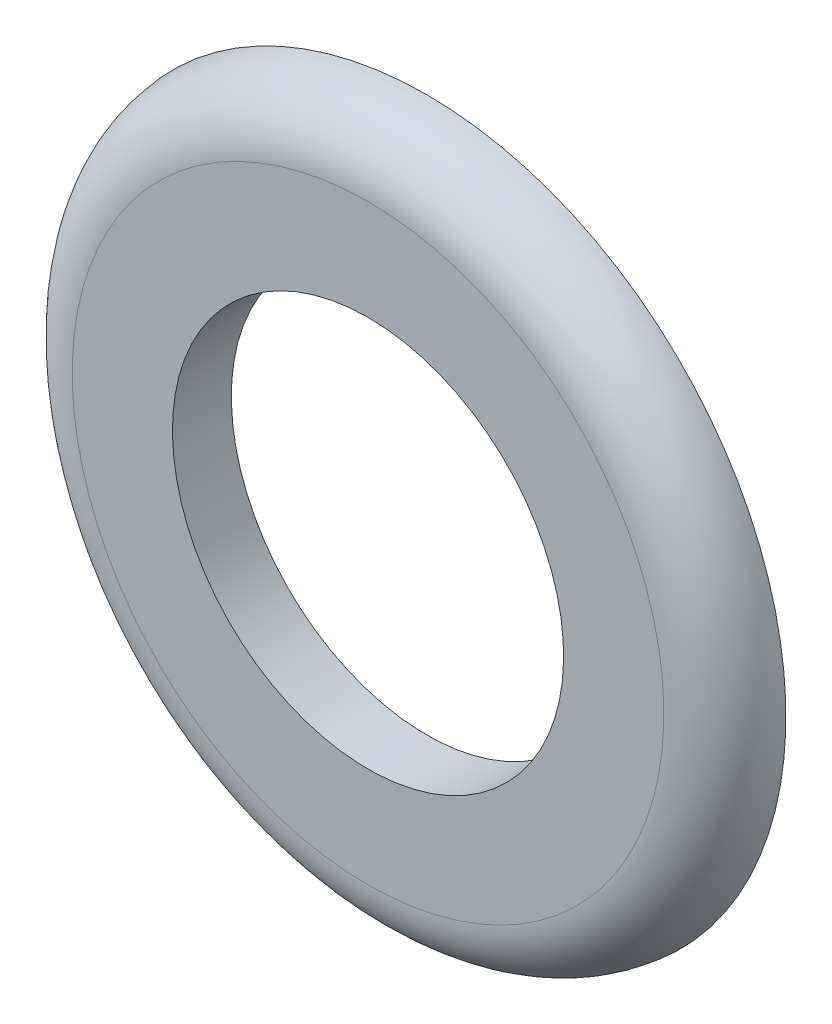
ISO-10303-21;
HEADER;
FILE_DESCRIPTION(('STEP AP214'),'2;1');
FILE_NAME('part.step','',(''),(''),'','','');
FILE_SCHEMA(('AUTOMOTIVE_DESIGN { 1 0 10303 214 1 1 1 1 }'));
ENDSEC;
DATA;
#1=APPLICATION_CONTEXT('core data for automotive mechanical design processes');
#2=APPLICATION_PROTOCOL_DEFINITION('international standard','automotive_design',2000,#1);
#3=PRODUCT_CONTEXT('',#1,'mechanical');
#4=PRODUCT('Part','Part','',(#3));
#5=PRODUCT_RELATED_PRODUCT_CATEGORY('part','',(#4));
#6=PRODUCT_DEFINITION_FORMATION('','',#4);
#7=PRODUCT_DEFINITION_CONTEXT('part definition',#1,'design');
#8=PRODUCT_DEFINITION('design','',#6,#7);
#9=PRODUCT_DEFINITION_SHAPE('','',#8);
#10=(LENGTH_UNIT() NAMED_UNIT(*) SI_UNIT(.MILLI.,.METRE.));
#11=(NAMED_UNIT(*) PLANE_ANGLE_UNIT() SI_UNIT($,.RADIAN.));
#12=(NAMED_UNIT(*) SI_UNIT($,.STERADIAN.) SOLID_ANGLE_UNIT());
#13=UNCERTAINTY_MEASURE_WITH_UNIT(LENGTH_MEASURE(1.E-05),#10,'distance_accuracy_value','');
#14=(GEOMETRIC_REPRESENTATION_CONTEXT(3) GLOBAL_UNCERTAINTY_ASSIGNED_CONTEXT((#13)) GLOBAL_UNIT_ASSIGNED_CONTEXT((#10,
#11,#12)) REPRESENTATION_CONTEXT('',''));
#15=CARTESIAN_POINT('',(0.,0.,0.));
#16=DIRECTION('',(0.,0.,1.));
#17=DIRECTION('',(1.,0.,0.));
#18=AXIS2_PLACEMENT_3D('',#15,#16,#17);
#19=CARTESIAN_POINT('',(0.,5.16666666666667,7.7714));
#20=DIRECTION('',(0.,0.,1.));
#21=DIRECTION('',(0.,-1.,0.));
#22=AXIS2_PLACEMENT_3D('',#19,#20,#21);
#23=PLANE('',#22);
#24=CARTESIAN_POINT('',(0.,0.,7.7714));
#25=DIRECTION('',(0.,0.,-1.));
#26=DIRECTION('',(0.,1.,0.));
#27=AXIS2_PLACEMENT_3D('',#24,#25,#26);
#28=CIRCLE('',#27,3.41595335602997);
#29=CARTESIAN_POINT('',(0.,3.41595335602996,7.7714));
#30=VERTEX_POINT('',#29);
#31=EDGE_CURVE('E21',#30,#30,#28,.T.);
#32=ORIENTED_EDGE('',*,*,#31,.T.);
#33=EDGE_LOOP('',(#32));
#34=FACE_BOUND('',#33,.T.);
#35=CARTESIAN_POINT('',(0.,0.,7.7714));
#36=DIRECTION('',(0.,0.,-1.));
#37=DIRECTION('',(0.,1.,0.));
#38=AXIS2_PLACEMENT_3D('',#35,#36,#37);
#39=CIRCLE('',#38,5.16666666666668);
#40=CARTESIAN_POINT('',(0.,5.16666666666667,7.7714));
#41=VERTEX_POINT('',#40);
#42=CARTESIAN_POINT('',(0.,-5.16666666666668,7.7714));
#43=VERTEX_POINT('',#42);
#44=EDGE_CURVE('E33',#41,#43,#39,.T.);
#45=ORIENTED_EDGE('',*,*,#44,.F.);
#46=CARTESIAN_POINT('',(0.,0.,7.7714));
#47=DIRECTION('',(0.,0.,-1.));
#48=DIRECTION('',(0.,-1.,0.));
#49=AXIS2_PLACEMENT_3D('',#46,#47,#48);
#50=CIRCLE('',#49,5.16666666666667);
#51=EDGE_CURVE('E36',#43,#41,#50,.T.);
#52=ORIENTED_EDGE('',*,*,#51,.F.);
#53=EDGE_LOOP('',(#45,#52));
#54=FACE_BOUND('',#53,.T.);
#55=ADVANCED_FACE('F17',(#34,#54),#23,.T.);
#56=CARTESIAN_POINT('',(0.,0.,6.66666666666667));
#57=DIRECTION('',(0.,0.,-1.));
#58=DIRECTION('',(0.,1.,0.));
#59=AXIS2_PLACEMENT_3D('',#56,#57,#58);
#60=TOROIDAL_SURFACE('',#59,5.16666666666667,1.10473333333333);
#61=ORIENTED_EDGE('',*,*,#44,.T.);
#62=ORIENTED_EDGE('',*,*,#51,.T.);
#63=EDGE_LOOP('',(#61,#62));
#64=FACE_BOUND('',#63,.T.);
#65=CARTESIAN_POINT('',(0.,0.,6.74286666666667));
#66=DIRECTION('',(0.,0.,-1.));
#67=DIRECTION('',(0.,1.,0.));
#68=AXIS2_PLACEMENT_3D('',#65,#66,#67);
#69=CIRCLE('',#68,6.26876888414824);
#70=CARTESIAN_POINT('',(0.,6.26876888414823,6.74286666666667));
#71=VERTEX_POINT('',#70);
#72=EDGE_CURVE('E27',#71,#71,#69,.T.);
#73=ORIENTED_EDGE('',*,*,#72,.F.);
#74=EDGE_LOOP('',(#73));
#75=FACE_BOUND('',#74,.T.);
#76=ADVANCED_FACE('F43',(#64,#75),#60,.T.);
#77=CARTESIAN_POINT('',(0.,0.,6.74286666666667));
#78=DIRECTION('',(0.,0.,-1.));
#79=DIRECTION('',(0.,1.,0.));
#80=AXIS2_PLACEMENT_3D('',#77,#78,#79);
#81=CYLINDRICAL_SURFACE('',#80,3.41595335602997);
#82=CARTESIAN_POINT('',(0.,0.,6.74286666666667));
#83=DIRECTION('',(0.,0.,-1.));
#84=DIRECTION('',(0.,1.,0.));
#85=AXIS2_PLACEMENT_3D('',#82,#83,#84);
#86=CIRCLE('',#85,3.41595335602997);
#87=CARTESIAN_POINT('',(0.,3.41595335602996,6.74286666666667));
#88=VERTEX_POINT('',#87);
#89=EDGE_CURVE('E11',#88,#88,#86,.F.);
#90=ORIENTED_EDGE('',*,*,#89,.F.);
#91=EDGE_LOOP('',(#90));
#92=FACE_BOUND('',#91,.T.);
#93=ORIENTED_EDGE('',*,*,#31,.F.);
#94=EDGE_LOOP('',(#93));
#95=FACE_BOUND('',#94,.T.);
#96=ADVANCED_FACE('F60',(#92,#95),#81,.F.);
#97=CARTESIAN_POINT('',(0.,3.41595335602997,6.74286666666667));
#98=DIRECTION('',(0.,0.,-1.));
#99=DIRECTION('',(0.,1.,0.));
#100=AXIS2_PLACEMENT_3D('',#97,#98,#99);
#101=PLANE('',#100);
#102=ORIENTED_EDGE('',*,*,#89,.T.);
#103=EDGE_LOOP('',(#102));
#104=FACE_BOUND('',#103,.T.);
#105=ORIENTED_EDGE('',*,*,#72,.T.);
#106=EDGE_LOOP('',(#105));
#107=FACE_BOUND('',#106,.T.);
#108=ADVANCED_FACE('F86',(#104,#107),#101,.T.);
#109=CLOSED_SHELL('',(#55,#76,#96,#108));
#110=MANIFOLD_SOLID_BREP('B1',#109);
#111=ADVANCED_BREP_SHAPE_REPRESENTATION('',(#18,#110),#14);
#112=SHAPE_DEFINITION_REPRESENTATION(#9,#111);
ENDSEC;
END-ISO-10303-21;
